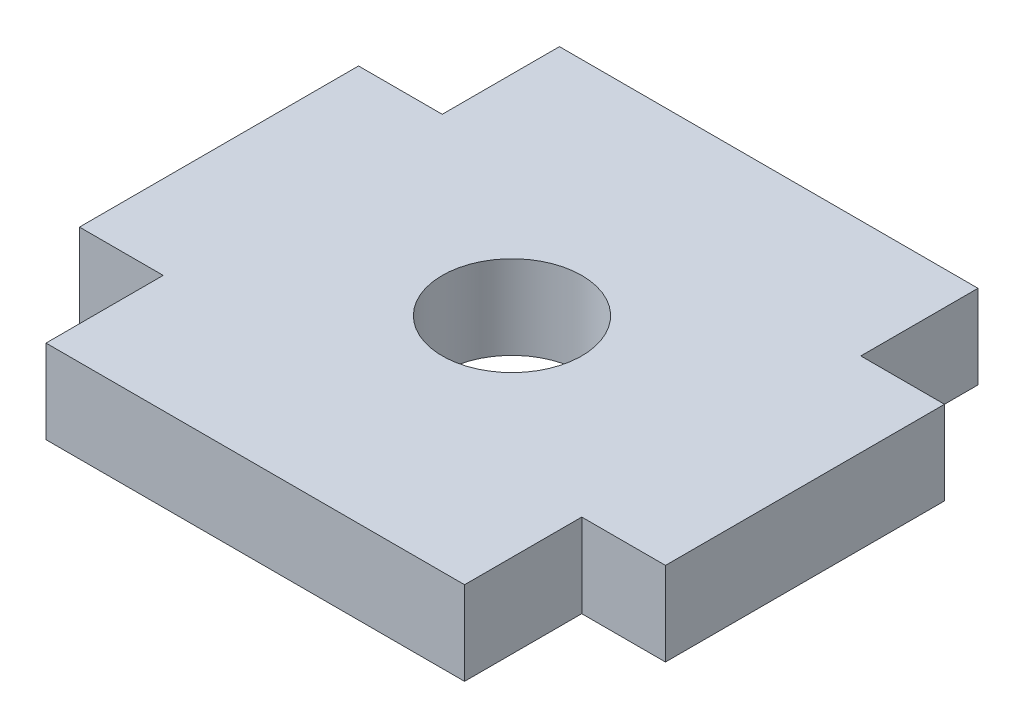
ISO-10303-21;
HEADER;
FILE_DESCRIPTION(('STEP AP214'),'2;1');
FILE_NAME('part.step','',(''),(''),'','','');
FILE_SCHEMA(('AUTOMOTIVE_DESIGN { 1 0 10303 214 1 1 1 1 }'));
ENDSEC;
DATA;
#1=APPLICATION_CONTEXT('core data for automotive mechanical design processes');
#2=APPLICATION_PROTOCOL_DEFINITION('international standard','automotive_design',2000,#1);
#3=PRODUCT_CONTEXT('',#1,'mechanical');
#4=PRODUCT('Part','Part','',(#3));
#5=PRODUCT_RELATED_PRODUCT_CATEGORY('part','',(#4));
#6=PRODUCT_DEFINITION_FORMATION('','',#4);
#7=PRODUCT_DEFINITION_CONTEXT('part definition',#1,'design');
#8=PRODUCT_DEFINITION('design','',#6,#7);
#9=PRODUCT_DEFINITION_SHAPE('','',#8);
#10=(LENGTH_UNIT() NAMED_UNIT(*) SI_UNIT(.MILLI.,.METRE.));
#11=(NAMED_UNIT(*) PLANE_ANGLE_UNIT() SI_UNIT($,.RADIAN.));
#12=(NAMED_UNIT(*) SI_UNIT($,.STERADIAN.) SOLID_ANGLE_UNIT());
#13=UNCERTAINTY_MEASURE_WITH_UNIT(LENGTH_MEASURE(1.E-05),#10,'distance_accuracy_value','');
#14=(GEOMETRIC_REPRESENTATION_CONTEXT(3) GLOBAL_UNCERTAINTY_ASSIGNED_CONTEXT((#13)) GLOBAL_UNIT_ASSIGNED_CONTEXT((#10,
#11,#12)) REPRESENTATION_CONTEXT('',''));
#15=CARTESIAN_POINT('',(0.,0.,0.));
#16=DIRECTION('',(0.,0.,1.));
#17=DIRECTION('',(1.,0.,0.));
#18=AXIS2_PLACEMENT_3D('',#15,#16,#17);
#19=CARTESIAN_POINT('',(-76.5,13.,-9.19991962660137));
#20=DIRECTION('',(0.,0.,-1.));
#21=DIRECTION('',(-1.,0.,0.));
#22=AXIS2_PLACEMENT_3D('',#19,#20,#21);
#23=PLANE('',#22);
#24=DIRECTION('',(1.,0.,0.));
#25=VECTOR('',#24,1.);
#26=CARTESIAN_POINT('',(-76.5,10.,-9.19991962660137));
#27=LINE('',#26,#25);
#28=CARTESIAN_POINT('',(-76.5,10.,-9.19991962660137));
#29=VERTEX_POINT('',#28);
#30=CARTESIAN_POINT('',(-61.5,10.,-9.19991962660137));
#31=VERTEX_POINT('',#30);
#32=EDGE_CURVE('E156',#29,#31,#27,.T.);
#33=ORIENTED_EDGE('',*,*,#32,.F.);
#34=DIRECTION('',(0.,-1.,0.));
#35=VECTOR('',#34,1.);
#36=CARTESIAN_POINT('',(-76.5,13.,-9.19991962660137));
#37=LINE('',#36,#35);
#38=CARTESIAN_POINT('',(-76.5,13.,-9.19991962660137));
#39=VERTEX_POINT('',#38);
#40=EDGE_CURVE('E11',#39,#29,#37,.T.);
#41=ORIENTED_EDGE('',*,*,#40,.F.);
#42=DIRECTION('',(1.,0.,0.));
#43=VECTOR('',#42,1.);
#44=CARTESIAN_POINT('',(-76.5,13.,-9.19991962660137));
#45=LINE('',#44,#43);
#46=CARTESIAN_POINT('',(-61.5,13.,-9.19991962660137));
#47=VERTEX_POINT('',#46);
#48=EDGE_CURVE('E189',#39,#47,#45,.T.);
#49=ORIENTED_EDGE('',*,*,#48,.T.);
#50=DIRECTION('',(0.,-1.,0.));
#51=VECTOR('',#50,1.);
#52=CARTESIAN_POINT('',(-61.5,13.,-9.19991962660137));
#53=LINE('',#52,#51);
#54=EDGE_CURVE('E38',#47,#31,#53,.T.);
#55=ORIENTED_EDGE('',*,*,#54,.T.);
#56=EDGE_LOOP('',(#33,#41,#49,#55));
#57=FACE_BOUND('',#56,.T.);
#58=ADVANCED_FACE('F35',(#57),#23,.T.);
#59=CARTESIAN_POINT('',(-76.5,13.,-5.));
#60=DIRECTION('',(-1.,0.,0.));
#61=DIRECTION('',(0.,0.,1.));
#62=AXIS2_PLACEMENT_3D('',#59,#60,#61);
#63=PLANE('',#62);
#64=DIRECTION('',(0.,0.,-1.));
#65=VECTOR('',#64,1.);
#66=CARTESIAN_POINT('',(-76.5,10.,-5.));
#67=LINE('',#66,#65);
#68=CARTESIAN_POINT('',(-76.5,10.,-5.));
#69=VERTEX_POINT('',#68);
#70=EDGE_CURVE('E187',#69,#29,#67,.T.);
#71=ORIENTED_EDGE('',*,*,#70,.F.);
#72=DIRECTION('',(0.,-1.,0.));
#73=VECTOR('',#72,1.);
#74=CARTESIAN_POINT('',(-76.5,13.,-5.));
#75=LINE('',#74,#73);
#76=CARTESIAN_POINT('',(-76.5,13.,-5.));
#77=VERTEX_POINT('',#76);
#78=EDGE_CURVE('E44',#77,#69,#75,.T.);
#79=ORIENTED_EDGE('',*,*,#78,.F.);
#80=DIRECTION('',(0.,0.,-1.));
#81=VECTOR('',#80,1.);
#82=CARTESIAN_POINT('',(-76.5,13.,-5.));
#83=LINE('',#82,#81);
#84=EDGE_CURVE('E146',#77,#39,#83,.T.);
#85=ORIENTED_EDGE('',*,*,#84,.T.);
#86=ORIENTED_EDGE('',*,*,#40,.T.);
#87=EDGE_LOOP('',(#71,#79,#85,#86));
#88=FACE_BOUND('',#87,.T.);
#89=ADVANCED_FACE('F209',(#88),#63,.T.);
#90=CARTESIAN_POINT('',(-79.5,13.,-5.));
#91=DIRECTION('',(0.,0.,-1.));
#92=DIRECTION('',(-1.,0.,0.));
#93=AXIS2_PLACEMENT_3D('',#90,#91,#92);
#94=PLANE('',#93);
#95=DIRECTION('',(1.,0.,0.));
#96=VECTOR('',#95,1.);
#97=CARTESIAN_POINT('',(-79.5,10.,-5.));
#98=LINE('',#97,#96);
#99=CARTESIAN_POINT('',(-79.5,10.,-5.));
#100=VERTEX_POINT('',#99);
#101=EDGE_CURVE('E133',#100,#69,#98,.T.);
#102=ORIENTED_EDGE('',*,*,#101,.F.);
#103=DIRECTION('',(0.,-1.,0.));
#104=VECTOR('',#103,1.);
#105=CARTESIAN_POINT('',(-79.5,13.,-5.));
#106=LINE('',#105,#104);
#107=CARTESIAN_POINT('',(-79.5,13.,-5.));
#108=VERTEX_POINT('',#107);
#109=EDGE_CURVE('E128',#108,#100,#106,.T.);
#110=ORIENTED_EDGE('',*,*,#109,.F.);
#111=DIRECTION('',(1.,0.,0.));
#112=VECTOR('',#111,1.);
#113=CARTESIAN_POINT('',(-79.5,13.,-5.));
#114=LINE('',#113,#112);
#115=EDGE_CURVE('E131',#108,#77,#114,.T.);
#116=ORIENTED_EDGE('',*,*,#115,.T.);
#117=ORIENTED_EDGE('',*,*,#78,.T.);
#118=EDGE_LOOP('',(#102,#110,#116,#117));
#119=FACE_BOUND('',#118,.T.);
#120=ADVANCED_FACE('F130',(#119),#94,.T.);
#121=CARTESIAN_POINT('',(-79.5,13.,5.));
#122=DIRECTION('',(-1.,0.,0.));
#123=DIRECTION('',(0.,0.,1.));
#124=AXIS2_PLACEMENT_3D('',#121,#122,#123);
#125=PLANE('',#124);
#126=DIRECTION('',(0.,0.,-1.));
#127=VECTOR('',#126,1.);
#128=CARTESIAN_POINT('',(-79.5,10.,5.));
#129=LINE('',#128,#127);
#130=CARTESIAN_POINT('',(-79.5,10.,5.));
#131=VERTEX_POINT('',#130);
#132=EDGE_CURVE('E184',#131,#100,#129,.T.);
#133=ORIENTED_EDGE('',*,*,#132,.F.);
#134=DIRECTION('',(0.,-1.,0.));
#135=VECTOR('',#134,1.);
#136=CARTESIAN_POINT('',(-79.5,13.,5.));
#137=LINE('',#136,#135);
#138=CARTESIAN_POINT('',(-79.5,13.,5.));
#139=VERTEX_POINT('',#138);
#140=EDGE_CURVE('E138',#139,#131,#137,.T.);
#141=ORIENTED_EDGE('',*,*,#140,.F.);
#142=DIRECTION('',(0.,0.,-1.));
#143=VECTOR('',#142,1.);
#144=CARTESIAN_POINT('',(-79.5,13.,5.));
#145=LINE('',#144,#143);
#146=EDGE_CURVE('E144',#139,#108,#145,.T.);
#147=ORIENTED_EDGE('',*,*,#146,.T.);
#148=ORIENTED_EDGE('',*,*,#109,.T.);
#149=EDGE_LOOP('',(#133,#141,#147,#148));
#150=FACE_BOUND('',#149,.T.);
#151=ADVANCED_FACE('F148',(#150),#125,.T.);
#152=CARTESIAN_POINT('',(-76.5,13.,5.));
#153=DIRECTION('',(0.,0.,1.));
#154=DIRECTION('',(1.,0.,0.));
#155=AXIS2_PLACEMENT_3D('',#152,#153,#154);
#156=PLANE('',#155);
#157=DIRECTION('',(-1.,0.,0.));
#158=VECTOR('',#157,1.);
#159=CARTESIAN_POINT('',(-76.5,10.,5.));
#160=LINE('',#159,#158);
#161=CARTESIAN_POINT('',(-76.5,10.,5.));
#162=VERTEX_POINT('',#161);
#163=EDGE_CURVE('E181',#162,#131,#160,.T.);
#164=ORIENTED_EDGE('',*,*,#163,.F.);
#165=DIRECTION('',(0.,-1.,0.));
#166=VECTOR('',#165,1.);
#167=CARTESIAN_POINT('',(-76.5,13.,5.));
#168=LINE('',#167,#166);
#169=CARTESIAN_POINT('',(-76.5,13.,5.));
#170=VERTEX_POINT('',#169);
#171=EDGE_CURVE('E193',#170,#162,#168,.T.);
#172=ORIENTED_EDGE('',*,*,#171,.F.);
#173=DIRECTION('',(-1.,0.,0.));
#174=VECTOR('',#173,1.);
#175=CARTESIAN_POINT('',(-76.5,13.,5.));
#176=LINE('',#175,#174);
#177=EDGE_CURVE('E149',#170,#139,#176,.T.);
#178=ORIENTED_EDGE('',*,*,#177,.T.);
#179=ORIENTED_EDGE('',*,*,#140,.T.);
#180=EDGE_LOOP('',(#164,#172,#178,#179));
#181=FACE_BOUND('',#180,.T.);
#182=ADVANCED_FACE('F222',(#181),#156,.T.);
#183=CARTESIAN_POINT('',(-76.5,13.,9.19991962660137));
#184=DIRECTION('',(-1.,0.,0.));
#185=DIRECTION('',(0.,0.,1.));
#186=AXIS2_PLACEMENT_3D('',#183,#184,#185);
#187=PLANE('',#186);
#188=DIRECTION('',(0.,0.,-1.));
#189=VECTOR('',#188,1.);
#190=CARTESIAN_POINT('',(-76.5,10.,9.19991962660137));
#191=LINE('',#190,#189);
#192=CARTESIAN_POINT('',(-76.5,10.,9.19991962660137));
#193=VERTEX_POINT('',#192);
#194=EDGE_CURVE('E178',#193,#162,#191,.T.);
#195=ORIENTED_EDGE('',*,*,#194,.F.);
#196=DIRECTION('',(0.,-1.,0.));
#197=VECTOR('',#196,1.);
#198=CARTESIAN_POINT('',(-76.5,13.,9.19991962660137));
#199=LINE('',#198,#197);
#200=CARTESIAN_POINT('',(-76.5,13.,9.19991962660137));
#201=VERTEX_POINT('',#200);
#202=EDGE_CURVE('E195',#201,#193,#199,.T.);
#203=ORIENTED_EDGE('',*,*,#202,.F.);
#204=DIRECTION('',(0.,0.,-1.));
#205=VECTOR('',#204,1.);
#206=CARTESIAN_POINT('',(-76.5,13.,9.19991962660137));
#207=LINE('',#206,#205);
#208=EDGE_CURVE('E151',#201,#170,#207,.T.);
#209=ORIENTED_EDGE('',*,*,#208,.T.);
#210=ORIENTED_EDGE('',*,*,#171,.T.);
#211=EDGE_LOOP('',(#195,#203,#209,#210));
#212=FACE_BOUND('',#211,.T.);
#213=ADVANCED_FACE('F225',(#212),#187,.T.);
#214=CARTESIAN_POINT('',(-61.5,13.,9.19991962660137));
#215=DIRECTION('',(0.,0.,1.));
#216=DIRECTION('',(1.,0.,0.));
#217=AXIS2_PLACEMENT_3D('',#214,#215,#216);
#218=PLANE('',#217);
#219=DIRECTION('',(-1.,0.,0.));
#220=VECTOR('',#219,1.);
#221=CARTESIAN_POINT('',(-61.5,10.,9.19991962660137));
#222=LINE('',#221,#220);
#223=CARTESIAN_POINT('',(-61.5,10.,9.19991962660137));
#224=VERTEX_POINT('',#223);
#225=EDGE_CURVE('E175',#224,#193,#222,.T.);
#226=ORIENTED_EDGE('',*,*,#225,.F.);
#227=DIRECTION('',(0.,-1.,0.));
#228=VECTOR('',#227,1.);
#229=CARTESIAN_POINT('',(-61.5,13.,9.19991962660137));
#230=LINE('',#229,#228);
#231=CARTESIAN_POINT('',(-61.5,13.,9.19991962660137));
#232=VERTEX_POINT('',#231);
#233=EDGE_CURVE('E197',#232,#224,#230,.T.);
#234=ORIENTED_EDGE('',*,*,#233,.F.);
#235=DIRECTION('',(-1.,0.,0.));
#236=VECTOR('',#235,1.);
#237=CARTESIAN_POINT('',(-61.5,13.,9.19991962660137));
#238=LINE('',#237,#236);
#239=EDGE_CURVE('E288',#232,#201,#238,.T.);
#240=ORIENTED_EDGE('',*,*,#239,.T.);
#241=ORIENTED_EDGE('',*,*,#202,.T.);
#242=EDGE_LOOP('',(#226,#234,#240,#241));
#243=FACE_BOUND('',#242,.T.);
#244=ADVANCED_FACE('F229',(#243),#218,.T.);
#245=CARTESIAN_POINT('',(-61.5,13.,5.));
#246=DIRECTION('',(1.,0.,0.));
#247=DIRECTION('',(0.,0.,-1.));
#248=AXIS2_PLACEMENT_3D('',#245,#246,#247);
#249=PLANE('',#248);
#250=DIRECTION('',(0.,0.,1.));
#251=VECTOR('',#250,1.);
#252=CARTESIAN_POINT('',(-61.5,10.,5.));
#253=LINE('',#252,#251);
#254=CARTESIAN_POINT('',(-61.5,10.,5.));
#255=VERTEX_POINT('',#254);
#256=EDGE_CURVE('E172',#255,#224,#253,.T.);
#257=ORIENTED_EDGE('',*,*,#256,.F.);
#258=DIRECTION('',(0.,-1.,0.));
#259=VECTOR('',#258,1.);
#260=CARTESIAN_POINT('',(-61.5,13.,5.));
#261=LINE('',#260,#259);
#262=CARTESIAN_POINT('',(-61.5,13.,5.));
#263=VERTEX_POINT('',#262);
#264=EDGE_CURVE('E199',#263,#255,#261,.T.);
#265=ORIENTED_EDGE('',*,*,#264,.F.);
#266=DIRECTION('',(0.,0.,1.));
#267=VECTOR('',#266,1.);
#268=CARTESIAN_POINT('',(-61.5,13.,5.));
#269=LINE('',#268,#267);
#270=EDGE_CURVE('E285',#263,#232,#269,.T.);
#271=ORIENTED_EDGE('',*,*,#270,.T.);
#272=ORIENTED_EDGE('',*,*,#233,.T.);
#273=EDGE_LOOP('',(#257,#265,#271,#272));
#274=FACE_BOUND('',#273,.T.);
#275=ADVANCED_FACE('F233',(#274),#249,.T.);
#276=CARTESIAN_POINT('',(-58.5,13.,5.));
#277=DIRECTION('',(0.,0.,1.));
#278=DIRECTION('',(1.,0.,0.));
#279=AXIS2_PLACEMENT_3D('',#276,#277,#278);
#280=PLANE('',#279);
#281=DIRECTION('',(-1.,0.,0.));
#282=VECTOR('',#281,1.);
#283=CARTESIAN_POINT('',(-58.5,10.,5.));
#284=LINE('',#283,#282);
#285=CARTESIAN_POINT('',(-58.5,10.,5.));
#286=VERTEX_POINT('',#285);
#287=EDGE_CURVE('E169',#286,#255,#284,.T.);
#288=ORIENTED_EDGE('',*,*,#287,.F.);
#289=DIRECTION('',(0.,-1.,0.));
#290=VECTOR('',#289,1.);
#291=CARTESIAN_POINT('',(-58.5,13.,5.));
#292=LINE('',#291,#290);
#293=CARTESIAN_POINT('',(-58.5,13.,5.));
#294=VERTEX_POINT('',#293);
#295=EDGE_CURVE('E201',#294,#286,#292,.T.);
#296=ORIENTED_EDGE('',*,*,#295,.F.);
#297=DIRECTION('',(-1.,0.,0.));
#298=VECTOR('',#297,1.);
#299=CARTESIAN_POINT('',(-58.5,13.,5.));
#300=LINE('',#299,#298);
#301=EDGE_CURVE('E282',#294,#263,#300,.T.);
#302=ORIENTED_EDGE('',*,*,#301,.T.);
#303=ORIENTED_EDGE('',*,*,#264,.T.);
#304=EDGE_LOOP('',(#288,#296,#302,#303));
#305=FACE_BOUND('',#304,.T.);
#306=ADVANCED_FACE('F237',(#305),#280,.T.);
#307=CARTESIAN_POINT('',(-58.5,13.,-5.));
#308=DIRECTION('',(1.,0.,0.));
#309=DIRECTION('',(0.,0.,-1.));
#310=AXIS2_PLACEMENT_3D('',#307,#308,#309);
#311=PLANE('',#310);
#312=DIRECTION('',(0.,0.,1.));
#313=VECTOR('',#312,1.);
#314=CARTESIAN_POINT('',(-58.5,10.,-5.));
#315=LINE('',#314,#313);
#316=CARTESIAN_POINT('',(-58.5,10.,-5.));
#317=VERTEX_POINT('',#316);
#318=EDGE_CURVE('E166',#317,#286,#315,.T.);
#319=ORIENTED_EDGE('',*,*,#318,.F.);
#320=DIRECTION('',(0.,-1.,0.));
#321=VECTOR('',#320,1.);
#322=CARTESIAN_POINT('',(-58.5,13.,-5.));
#323=LINE('',#322,#321);
#324=CARTESIAN_POINT('',(-58.5,13.,-5.));
#325=VERTEX_POINT('',#324);
#326=EDGE_CURVE('E203',#325,#317,#323,.T.);
#327=ORIENTED_EDGE('',*,*,#326,.F.);
#328=DIRECTION('',(0.,0.,1.));
#329=VECTOR('',#328,1.);
#330=CARTESIAN_POINT('',(-58.5,13.,-5.));
#331=LINE('',#330,#329);
#332=EDGE_CURVE('E279',#325,#294,#331,.T.);
#333=ORIENTED_EDGE('',*,*,#332,.T.);
#334=ORIENTED_EDGE('',*,*,#295,.T.);
#335=EDGE_LOOP('',(#319,#327,#333,#334));
#336=FACE_BOUND('',#335,.T.);
#337=ADVANCED_FACE('F241',(#336),#311,.T.);
#338=CARTESIAN_POINT('',(-61.5,13.,-5.));
#339=DIRECTION('',(0.,0.,-1.));
#340=DIRECTION('',(-1.,0.,0.));
#341=AXIS2_PLACEMENT_3D('',#338,#339,#340);
#342=PLANE('',#341);
#343=DIRECTION('',(1.,0.,0.));
#344=VECTOR('',#343,1.);
#345=CARTESIAN_POINT('',(-61.5,10.,-5.));
#346=LINE('',#345,#344);
#347=CARTESIAN_POINT('',(-61.5,10.,-5.));
#348=VERTEX_POINT('',#347);
#349=EDGE_CURVE('E163',#348,#317,#346,.T.);
#350=ORIENTED_EDGE('',*,*,#349,.F.);
#351=DIRECTION('',(0.,-1.,0.));
#352=VECTOR('',#351,1.);
#353=CARTESIAN_POINT('',(-61.5,13.,-5.));
#354=LINE('',#353,#352);
#355=CARTESIAN_POINT('',(-61.5,13.,-5.));
#356=VERTEX_POINT('',#355);
#357=EDGE_CURVE('E204',#356,#348,#354,.T.);
#358=ORIENTED_EDGE('',*,*,#357,.F.);
#359=DIRECTION('',(1.,0.,0.));
#360=VECTOR('',#359,1.);
#361=CARTESIAN_POINT('',(-61.5,13.,-5.));
#362=LINE('',#361,#360);
#363=EDGE_CURVE('E276',#356,#325,#362,.T.);
#364=ORIENTED_EDGE('',*,*,#363,.T.);
#365=ORIENTED_EDGE('',*,*,#326,.T.);
#366=EDGE_LOOP('',(#350,#358,#364,#365));
#367=FACE_BOUND('',#366,.T.);
#368=ADVANCED_FACE('F245',(#367),#342,.T.);
#369=CARTESIAN_POINT('',(-61.5,13.,-9.19991962660137));
#370=DIRECTION('',(1.,0.,0.));
#371=DIRECTION('',(0.,0.,-1.));
#372=AXIS2_PLACEMENT_3D('',#369,#370,#371);
#373=PLANE('',#372);
#374=DIRECTION('',(0.,0.,1.));
#375=VECTOR('',#374,1.);
#376=CARTESIAN_POINT('',(-61.5,10.,-9.19991962660137));
#377=LINE('',#376,#375);
#378=EDGE_CURVE('E159',#31,#348,#377,.T.);
#379=ORIENTED_EDGE('',*,*,#378,.F.);
#380=ORIENTED_EDGE('',*,*,#54,.F.);
#381=DIRECTION('',(0.,0.,1.));
#382=VECTOR('',#381,1.);
#383=CARTESIAN_POINT('',(-61.5,13.,-9.19991962660137));
#384=LINE('',#383,#382);
#385=EDGE_CURVE('E274',#47,#356,#384,.T.);
#386=ORIENTED_EDGE('',*,*,#385,.T.);
#387=ORIENTED_EDGE('',*,*,#357,.T.);
#388=EDGE_LOOP('',(#379,#380,#386,#387));
#389=FACE_BOUND('',#388,.T.);
#390=ADVANCED_FACE('F206',(#389),#373,.T.);
#391=CARTESIAN_POINT('',(0.,13.,0.));
#392=DIRECTION('',(0.,-1.,0.));
#393=DIRECTION('',(0.,0.,-1.));
#394=AXIS2_PLACEMENT_3D('',#391,#392,#393);
#395=PLANE('',#394);
#396=CARTESIAN_POINT('',(-69.,13.,0.));
#397=DIRECTION('',(0.,-1.,0.));
#398=DIRECTION('',(0.,0.,-1.));
#399=AXIS2_PLACEMENT_3D('',#396,#397,#398);
#400=CIRCLE('',#399,2.5);
#401=CARTESIAN_POINT('',(-69.,13.,-2.49999999999999));
#402=VERTEX_POINT('',#401);
#403=EDGE_CURVE('E160',#402,#402,#400,.T.);
#404=ORIENTED_EDGE('',*,*,#403,.T.);
#405=EDGE_LOOP('',(#404));
#406=FACE_BOUND('',#405,.T.);
#407=ORIENTED_EDGE('',*,*,#48,.F.);
#408=ORIENTED_EDGE('',*,*,#84,.F.);
#409=ORIENTED_EDGE('',*,*,#115,.F.);
#410=ORIENTED_EDGE('',*,*,#146,.F.);
#411=ORIENTED_EDGE('',*,*,#177,.F.);
#412=ORIENTED_EDGE('',*,*,#208,.F.);
#413=ORIENTED_EDGE('',*,*,#239,.F.);
#414=ORIENTED_EDGE('',*,*,#270,.F.);
#415=ORIENTED_EDGE('',*,*,#301,.F.);
#416=ORIENTED_EDGE('',*,*,#332,.F.);
#417=ORIENTED_EDGE('',*,*,#363,.F.);
#418=ORIENTED_EDGE('',*,*,#385,.F.);
#419=EDGE_LOOP('',(#407,#408,#409,#410,#411,#412,#413,#414,#415,#416,#417,#418));
#420=FACE_BOUND('',#419,.T.);
#421=ADVANCED_FACE('F142',(#406,#420),#395,.F.);
#422=CARTESIAN_POINT('',(0.,10.,0.));
#423=DIRECTION('',(0.,-1.,0.));
#424=DIRECTION('',(0.,0.,-1.));
#425=AXIS2_PLACEMENT_3D('',#422,#423,#424);
#426=PLANE('',#425);
#427=CARTESIAN_POINT('',(-69.,10.,0.));
#428=DIRECTION('',(0.,-1.,0.));
#429=DIRECTION('',(0.,0.,-1.));
#430=AXIS2_PLACEMENT_3D('',#427,#428,#429);
#431=CIRCLE('',#430,2.5);
#432=CARTESIAN_POINT('',(-69.,10.,-2.49999999999999));
#433=VERTEX_POINT('',#432);
#434=EDGE_CURVE('E269',#433,#433,#431,.T.);
#435=ORIENTED_EDGE('',*,*,#434,.F.);
#436=EDGE_LOOP('',(#435));
#437=FACE_BOUND('',#436,.T.);
#438=ORIENTED_EDGE('',*,*,#32,.T.);
#439=ORIENTED_EDGE('',*,*,#378,.T.);
#440=ORIENTED_EDGE('',*,*,#349,.T.);
#441=ORIENTED_EDGE('',*,*,#318,.T.);
#442=ORIENTED_EDGE('',*,*,#287,.T.);
#443=ORIENTED_EDGE('',*,*,#256,.T.);
#444=ORIENTED_EDGE('',*,*,#225,.T.);
#445=ORIENTED_EDGE('',*,*,#194,.T.);
#446=ORIENTED_EDGE('',*,*,#163,.T.);
#447=ORIENTED_EDGE('',*,*,#132,.T.);
#448=ORIENTED_EDGE('',*,*,#101,.T.);
#449=ORIENTED_EDGE('',*,*,#70,.T.);
#450=EDGE_LOOP('',(#438,#439,#440,#441,#442,#443,#444,#445,#446,#447,#448,#449));
#451=FACE_BOUND('',#450,.T.);
#452=ADVANCED_FACE('F208',(#437,#451),#426,.T.);
#453=CARTESIAN_POINT('',(-69.,13.,0.));
#454=DIRECTION('',(0.,-1.,0.));
#455=DIRECTION('',(0.,0.,-1.));
#456=AXIS2_PLACEMENT_3D('',#453,#454,#455);
#457=CYLINDRICAL_SURFACE('',#456,2.5);
#458=ORIENTED_EDGE('',*,*,#403,.F.);
#459=EDGE_LOOP('',(#458));
#460=FACE_BOUND('',#459,.T.);
#461=ORIENTED_EDGE('',*,*,#434,.T.);
#462=EDGE_LOOP('',(#461));
#463=FACE_BOUND('',#462,.T.);
#464=ADVANCED_FACE('F257',(#460,#463),#457,.F.);
#465=CLOSED_SHELL('',(#58,#89,#120,#151,#182,#213,#244,#275,#306,#337,#368,#390,#421,#452,#464));
#466=MANIFOLD_SOLID_BREP('B2',#465);
#467=ADVANCED_BREP_SHAPE_REPRESENTATION('',(#18,#466),#14);
#468=SHAPE_DEFINITION_REPRESENTATION(#9,#467);
ENDSEC;
END-ISO-10303-21;
